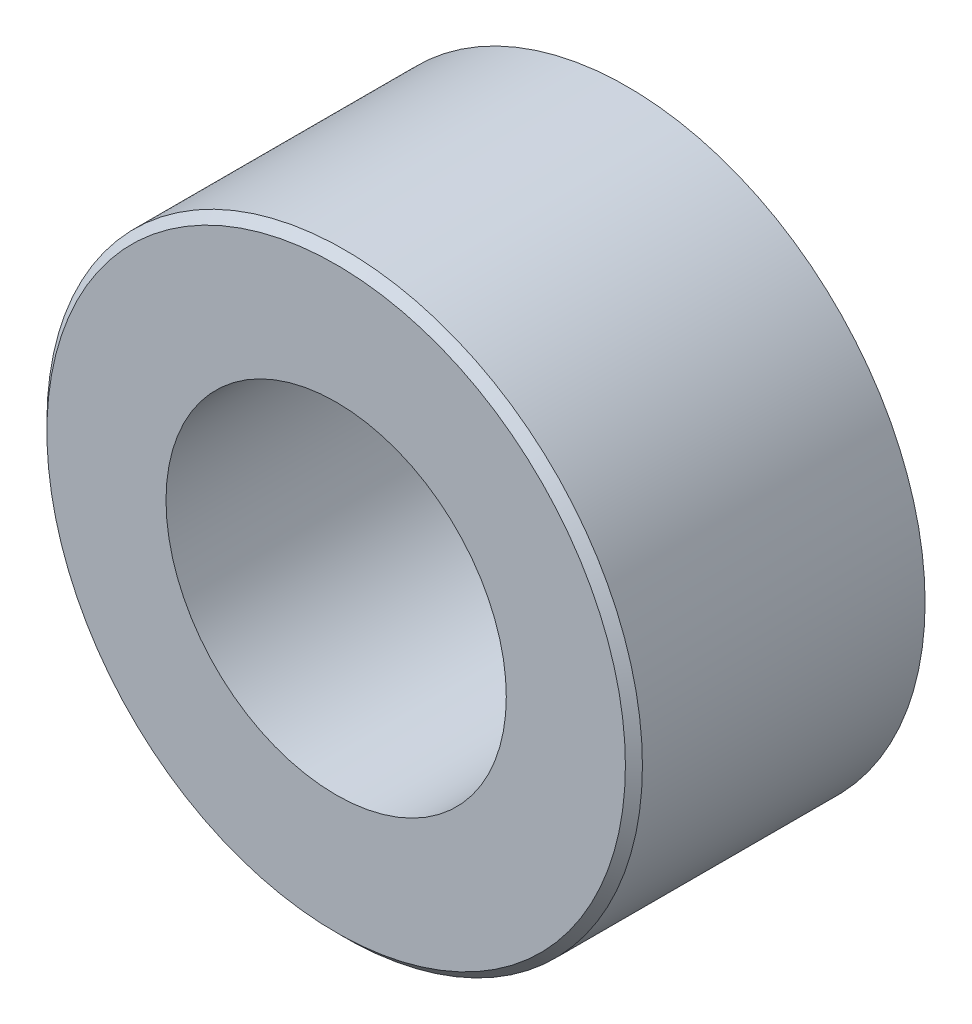
ISO-10303-21;
HEADER;
FILE_DESCRIPTION(('STEP AP214'),'2;1');
FILE_NAME('part.step','',(''),(''),'','','');
FILE_SCHEMA(('AUTOMOTIVE_DESIGN { 1 0 10303 214 1 1 1 1 }'));
ENDSEC;
DATA;
#1=APPLICATION_CONTEXT('core data for automotive mechanical design processes');
#2=APPLICATION_PROTOCOL_DEFINITION('international standard','automotive_design',2000,#1);
#3=PRODUCT_CONTEXT('',#1,'mechanical');
#4=PRODUCT('Part','Part','',(#3));
#5=PRODUCT_RELATED_PRODUCT_CATEGORY('part','',(#4));
#6=PRODUCT_DEFINITION_FORMATION('','',#4);
#7=PRODUCT_DEFINITION_CONTEXT('part definition',#1,'design');
#8=PRODUCT_DEFINITION('design','',#6,#7);
#9=PRODUCT_DEFINITION_SHAPE('','',#8);
#10=(LENGTH_UNIT() NAMED_UNIT(*) SI_UNIT(.MILLI.,.METRE.));
#11=(NAMED_UNIT(*) PLANE_ANGLE_UNIT() SI_UNIT($,.RADIAN.));
#12=(NAMED_UNIT(*) SI_UNIT($,.STERADIAN.) SOLID_ANGLE_UNIT());
#13=UNCERTAINTY_MEASURE_WITH_UNIT(LENGTH_MEASURE(1.E-05),#10,'distance_accuracy_value','');
#14=(GEOMETRIC_REPRESENTATION_CONTEXT(3) GLOBAL_UNCERTAINTY_ASSIGNED_CONTEXT((#13)) GLOBAL_UNIT_ASSIGNED_CONTEXT((#10,
#11,#12)) REPRESENTATION_CONTEXT('',''));
#15=CARTESIAN_POINT('',(0.,0.,0.));
#16=DIRECTION('',(0.,0.,1.));
#17=DIRECTION('',(1.,0.,0.));
#18=AXIS2_PLACEMENT_3D('',#15,#16,#17);
#19=CARTESIAN_POINT('',(0.,0.,8.));
#20=DIRECTION('',(0.,0.,1.));
#21=DIRECTION('',(1.,0.,0.));
#22=AXIS2_PLACEMENT_3D('',#19,#20,#21);
#23=PLANE('',#22);
#24=CARTESIAN_POINT('',(0.,0.,8.));
#25=DIRECTION('',(0.,0.,1.));
#26=DIRECTION('',(1.,0.,0.));
#27=AXIS2_PLACEMENT_3D('',#24,#25,#26);
#28=CIRCLE('',#27,6.8);
#29=CARTESIAN_POINT('',(6.8,0.,8.));
#30=VERTEX_POINT('',#29);
#31=EDGE_CURVE('E51',#30,#30,#28,.T.);
#32=ORIENTED_EDGE('',*,*,#31,.T.);
#33=EDGE_LOOP('',(#32));
#34=FACE_BOUND('',#33,.T.);
#35=CARTESIAN_POINT('',(0.,0.,8.));
#36=DIRECTION('',(0.,0.,1.));
#37=DIRECTION('',(1.,0.,0.));
#38=AXIS2_PLACEMENT_3D('',#35,#36,#37);
#39=CIRCLE('',#38,4.);
#40=CARTESIAN_POINT('',(4.,0.,8.));
#41=VERTEX_POINT('',#40);
#42=EDGE_CURVE('E56',#41,#41,#39,.T.);
#43=ORIENTED_EDGE('',*,*,#42,.F.);
#44=EDGE_LOOP('',(#43));
#45=FACE_BOUND('',#44,.T.);
#46=ADVANCED_FACE('F35',(#34,#45),#23,.T.);
#47=CARTESIAN_POINT('',(0.,0.,0.));
#48=DIRECTION('',(0.,0.,1.));
#49=DIRECTION('',(1.,0.,0.));
#50=AXIS2_PLACEMENT_3D('',#47,#48,#49);
#51=PLANE('',#50);
#52=CARTESIAN_POINT('',(0.,0.,0.));
#53=DIRECTION('',(0.,0.,1.));
#54=DIRECTION('',(1.,0.,0.));
#55=AXIS2_PLACEMENT_3D('',#52,#53,#54);
#56=CIRCLE('',#55,4.99999999999999);
#57=CARTESIAN_POINT('',(4.99999999999999,0.,0.));
#58=VERTEX_POINT('',#57);
#59=EDGE_CURVE('E10',#58,#58,#56,.F.);
#60=ORIENTED_EDGE('',*,*,#59,.T.);
#61=EDGE_LOOP('',(#60));
#62=FACE_BOUND('',#61,.T.);
#63=CARTESIAN_POINT('',(0.,0.,0.));
#64=DIRECTION('',(0.,0.,1.));
#65=DIRECTION('',(1.,0.,0.));
#66=AXIS2_PLACEMENT_3D('',#63,#64,#65);
#67=CIRCLE('',#66,4.);
#68=CARTESIAN_POINT('',(4.,0.,0.));
#69=VERTEX_POINT('',#68);
#70=EDGE_CURVE('E57',#69,#69,#67,.T.);
#71=ORIENTED_EDGE('',*,*,#70,.T.);
#72=EDGE_LOOP('',(#71));
#73=FACE_BOUND('',#72,.T.);
#74=ADVANCED_FACE('F67',(#62,#73),#51,.F.);
#75=CARTESIAN_POINT('',(0.,0.,8.));
#76=DIRECTION('',(0.,0.,-1.));
#77=DIRECTION('',(-1.,0.,0.));
#78=AXIS2_PLACEMENT_3D('',#75,#76,#77);
#79=CYLINDRICAL_SURFACE('',#78,7.);
#80=CARTESIAN_POINT('',(0.,0.,1.15470053837925));
#81=DIRECTION('',(0.,0.,1.));
#82=DIRECTION('',(1.,0.,0.));
#83=AXIS2_PLACEMENT_3D('',#80,#81,#82);
#84=CIRCLE('',#83,7.);
#85=CARTESIAN_POINT('',(7.,0.,1.15470053837925));
#86=VERTEX_POINT('',#85);
#87=EDGE_CURVE('E43',#86,#86,#84,.T.);
#88=ORIENTED_EDGE('',*,*,#87,.T.);
#89=EDGE_LOOP('',(#88));
#90=FACE_BOUND('',#89,.T.);
#91=CARTESIAN_POINT('',(0.,0.,7.8));
#92=DIRECTION('',(0.,0.,1.));
#93=DIRECTION('',(1.,0.,0.));
#94=AXIS2_PLACEMENT_3D('',#91,#92,#93);
#95=CIRCLE('',#94,7.);
#96=CARTESIAN_POINT('',(7.,0.,7.8));
#97=VERTEX_POINT('',#96);
#98=EDGE_CURVE('E47',#97,#97,#95,.F.);
#99=ORIENTED_EDGE('',*,*,#98,.T.);
#100=EDGE_LOOP('',(#99));
#101=FACE_BOUND('',#100,.T.);
#102=ADVANCED_FACE('F73',(#90,#101),#79,.T.);
#103=CARTESIAN_POINT('',(0.,0.,8.));
#104=DIRECTION('',(0.,0.,-1.));
#105=DIRECTION('',(-1.,0.,0.));
#106=AXIS2_PLACEMENT_3D('',#103,#104,#105);
#107=CYLINDRICAL_SURFACE('',#106,4.);
#108=ORIENTED_EDGE('',*,*,#42,.T.);
#109=EDGE_LOOP('',(#108));
#110=FACE_BOUND('',#109,.T.);
#111=ORIENTED_EDGE('',*,*,#70,.F.);
#112=EDGE_LOOP('',(#111));
#113=FACE_BOUND('',#112,.T.);
#114=ADVANCED_FACE('F63',(#110,#113),#107,.F.);
#115=CARTESIAN_POINT('',(0.,0.,8.));
#116=DIRECTION('',(0.,0.,-1.));
#117=DIRECTION('',(-1.,0.,0.));
#118=AXIS2_PLACEMENT_3D('',#115,#116,#117);
#119=CONICAL_SURFACE('',#118,6.8,0.785398163397446);
#120=ORIENTED_EDGE('',*,*,#98,.F.);
#121=EDGE_LOOP('',(#120));
#122=FACE_BOUND('',#121,.T.);
#123=ORIENTED_EDGE('',*,*,#31,.F.);
#124=EDGE_LOOP('',(#123));
#125=FACE_BOUND('',#124,.T.);
#126=ADVANCED_FACE('F79',(#122,#125),#119,.T.);
#127=CARTESIAN_POINT('',(0.,0.,1.15470053837925));
#128=DIRECTION('',(0.,0.,1.));
#129=DIRECTION('',(1.,0.,0.));
#130=AXIS2_PLACEMENT_3D('',#127,#128,#129);
#131=CONICAL_SURFACE('',#130,7.,1.0471975511966);
#132=ORIENTED_EDGE('',*,*,#59,.F.);
#133=EDGE_LOOP('',(#132));
#134=FACE_BOUND('',#133,.T.);
#135=ORIENTED_EDGE('',*,*,#87,.F.);
#136=EDGE_LOOP('',(#135));
#137=FACE_BOUND('',#136,.T.);
#138=ADVANCED_FACE('F38',(#134,#137),#131,.T.);
#139=CLOSED_SHELL('',(#46,#74,#102,#114,#126,#138));
#140=MANIFOLD_SOLID_BREP('B2',#139);
#141=ADVANCED_BREP_SHAPE_REPRESENTATION('',(#18,#140),#14);
#142=SHAPE_DEFINITION_REPRESENTATION(#9,#141);
ENDSEC;
END-ISO-10303-21;
